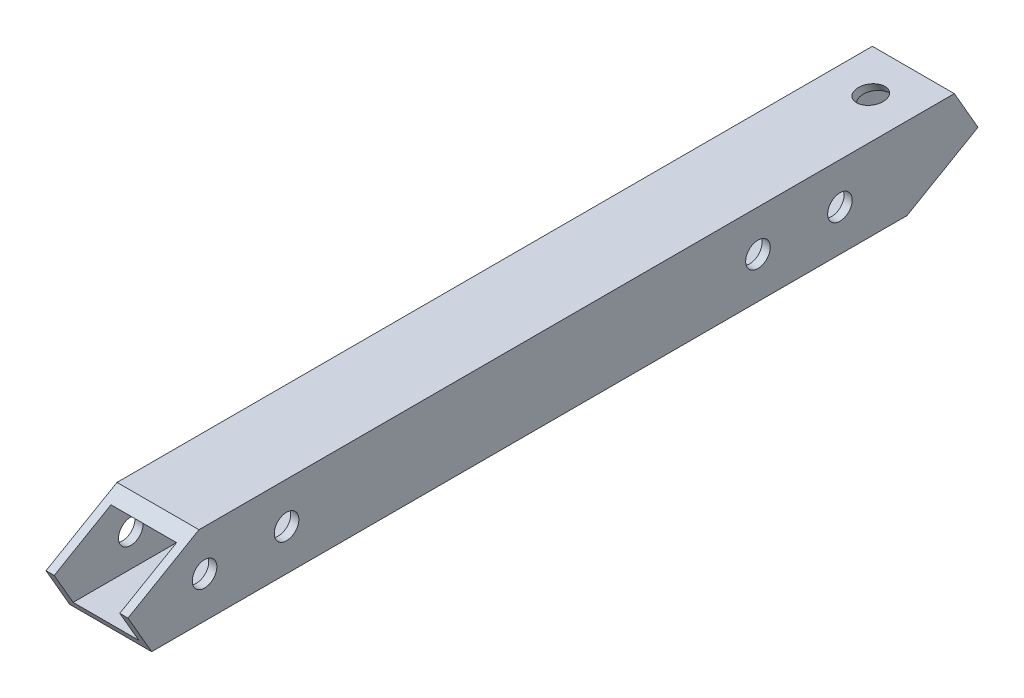
ISO-10303-21;
HEADER;
FILE_DESCRIPTION(('STEP AP214'),'2;1');
FILE_NAME('part.step','',(''),(''),'','','');
FILE_SCHEMA(('AUTOMOTIVE_DESIGN { 1 0 10303 214 1 1 1 1 }'));
ENDSEC;
DATA;
#1=APPLICATION_CONTEXT('core data for automotive mechanical design processes');
#2=APPLICATION_PROTOCOL_DEFINITION('international standard','automotive_design',2000,#1);
#3=PRODUCT_CONTEXT('',#1,'mechanical');
#4=PRODUCT('Part','Part','',(#3));
#5=PRODUCT_RELATED_PRODUCT_CATEGORY('part','',(#4));
#6=PRODUCT_DEFINITION_FORMATION('','',#4);
#7=PRODUCT_DEFINITION_CONTEXT('part definition',#1,'design');
#8=PRODUCT_DEFINITION('design','',#6,#7);
#9=PRODUCT_DEFINITION_SHAPE('','',#8);
#10=(LENGTH_UNIT() NAMED_UNIT(*) SI_UNIT(.MILLI.,.METRE.));
#11=(NAMED_UNIT(*) PLANE_ANGLE_UNIT() SI_UNIT($,.RADIAN.));
#12=(NAMED_UNIT(*) SI_UNIT($,.STERADIAN.) SOLID_ANGLE_UNIT());
#13=UNCERTAINTY_MEASURE_WITH_UNIT(LENGTH_MEASURE(1.E-05),#10,'distance_accuracy_value','');
#14=(GEOMETRIC_REPRESENTATION_CONTEXT(3) GLOBAL_UNCERTAINTY_ASSIGNED_CONTEXT((#13)) GLOBAL_UNIT_ASSIGNED_CONTEXT((#10,
#11,#12)) REPRESENTATION_CONTEXT('',''));
#15=CARTESIAN_POINT('',(0.,0.,0.));
#16=DIRECTION('',(0.,0.,1.));
#17=DIRECTION('',(1.,0.,0.));
#18=AXIS2_PLACEMENT_3D('',#15,#16,#17);
#19=CARTESIAN_POINT('',(-5.,4.,121.));
#20=DIRECTION('',(0.,-1.,0.));
#21=DIRECTION('',(0.,0.,-1.));
#22=AXIS2_PLACEMENT_3D('',#19,#20,#21);
#23=PLANE('',#22);
#24=CARTESIAN_POINT('',(0.,4.,16.1658075373093));
#25=DIRECTION('',(0.,-1.,0.));
#26=DIRECTION('',(0.,0.,1.));
#27=AXIS2_PLACEMENT_3D('',#24,#25,#26);
#28=ELLIPSE('',#27,1.73205080756888,1.5);
#29=CARTESIAN_POINT('',(0.,4.,17.8978583448782));
#30=VERTEX_POINT('',#29);
#31=EDGE_CURVE('E208',#30,#30,#28,.T.);
#32=ORIENTED_EDGE('',*,*,#31,.F.);
#33=EDGE_LOOP('',(#32));
#34=FACE_BOUND('',#33,.T.);
#35=DIRECTION('',(-1.,0.,0.));
#36=VECTOR('',#35,1.);
#37=CARTESIAN_POINT('',(-5.,4.,10.9696551146026));
#38=LINE('',#37,#36);
#39=CARTESIAN_POINT('',(3.99999999999999,4.,10.9696551146026));
#40=VERTEX_POINT('',#39);
#41=CARTESIAN_POINT('',(-4.,4.,10.9696551146026));
#42=VERTEX_POINT('',#41);
#43=EDGE_CURVE('E275',#40,#42,#38,.T.);
#44=ORIENTED_EDGE('',*,*,#43,.F.);
#45=DIRECTION('',(0.,0.,-1.));
#46=VECTOR('',#45,1.);
#47=CARTESIAN_POINT('',(3.99999999999999,4.,121.));
#48=LINE('',#47,#46);
#49=CARTESIAN_POINT('',(3.99999999999999,4.,105.41154273188));
#50=VERTEX_POINT('',#49);
#51=EDGE_CURVE('E255',#50,#40,#48,.T.);
#52=ORIENTED_EDGE('',*,*,#51,.F.);
#53=DIRECTION('',(1.,0.,0.));
#54=VECTOR('',#53,1.);
#55=CARTESIAN_POINT('',(-5.,4.,105.41154273188));
#56=LINE('',#55,#54);
#57=CARTESIAN_POINT('',(-4.,4.,105.41154273188));
#58=VERTEX_POINT('',#57);
#59=EDGE_CURVE('E273',#58,#50,#56,.T.);
#60=ORIENTED_EDGE('',*,*,#59,.F.);
#61=DIRECTION('',(0.,0.,-1.));
#62=VECTOR('',#61,1.);
#63=CARTESIAN_POINT('',(-4.,4.,121.));
#64=LINE('',#63,#62);
#65=EDGE_CURVE('E252',#58,#42,#64,.T.);
#66=ORIENTED_EDGE('',*,*,#65,.T.);
#67=EDGE_LOOP('',(#44,#52,#60,#66));
#68=FACE_BOUND('',#67,.T.);
#69=ADVANCED_FACE('F63',(#34,#68),#23,.T.);
#70=CARTESIAN_POINT('',(3.99999999999999,5.,121.));
#71=DIRECTION('',(-1.,0.,0.));
#72=DIRECTION('',(0.,0.,1.));
#73=AXIS2_PLACEMENT_3D('',#70,#71,#72);
#74=PLANE('',#73);
#75=DIRECTION('',(0.,0.500000000000005,-0.866025403784436));
#76=VECTOR('',#75,1.);
#77=CARTESIAN_POINT('',(3.99999999999999,-47.3945369289588,90.7499999999994));
#78=LINE('',#77,#76);
#79=CARTESIAN_POINT('',(3.99999999999999,-3.99999999999999,15.5884572681197));
#80=VERTEX_POINT('',#79);
#81=CARTESIAN_POINT('',(3.99999999999999,0.,8.66025403784416));
#82=VERTEX_POINT('',#81);
#83=EDGE_CURVE('E12',#80,#82,#78,.T.);
#84=ORIENTED_EDGE('',*,*,#83,.F.);
#85=DIRECTION('',(0.,0.,-1.));
#86=VECTOR('',#85,1.);
#87=CARTESIAN_POINT('',(3.99999999999999,-3.99999999999999,121.));
#88=LINE('',#87,#86);
#89=CARTESIAN_POINT('',(3.99999999999999,-3.99999999999999,110.030344885397));
#90=VERTEX_POINT('',#89);
#91=EDGE_CURVE('E258',#90,#80,#88,.T.);
#92=ORIENTED_EDGE('',*,*,#91,.F.);
#93=DIRECTION('',(0.,-0.866025403784439,-0.5));
#94=VECTOR('',#93,1.);
#95=CARTESIAN_POINT('',(3.99999999999999,7.5,116.669872981078));
#96=LINE('',#95,#94);
#97=CARTESIAN_POINT('',(3.99999999999999,0.,112.339745962156));
#98=VERTEX_POINT('',#97);
#99=EDGE_CURVE('E72',#98,#90,#96,.T.);
#100=ORIENTED_EDGE('',*,*,#99,.F.);
#101=DIRECTION('',(0.,-0.499999999999998,0.866025403784439));
#102=VECTOR('',#101,1.);
#103=CARTESIAN_POINT('',(3.99999999999999,-2.50000000000001,116.669872981078));
#104=LINE('',#103,#102);
#105=EDGE_CURVE('E154',#50,#98,#104,.T.);
#106=ORIENTED_EDGE('',*,*,#105,.F.);
#107=ORIENTED_EDGE('',*,*,#51,.T.);
#108=DIRECTION('',(0.,0.866025403784436,0.500000000000004));
#109=VECTOR('',#108,1.);
#110=CARTESIAN_POINT('',(3.99999999999999,52.3945369289589,38.9102540378447));
#111=LINE('',#110,#109);
#112=EDGE_CURVE('E224',#82,#40,#111,.T.);
#113=ORIENTED_EDGE('',*,*,#112,.F.);
#114=EDGE_LOOP('',(#84,#92,#100,#106,#107,#113));
#115=FACE_BOUND('',#114,.T.);
#116=CARTESIAN_POINT('',(3.99999999999999,0.,25.5));
#117=DIRECTION('',(-1.,0.,0.));
#118=DIRECTION('',(0.,0.,1.));
#119=AXIS2_PLACEMENT_3D('',#116,#117,#118);
#120=CIRCLE('',#119,1.5);
#121=CARTESIAN_POINT('',(3.99999999999999,0.,27.));
#122=VERTEX_POINT('',#121);
#123=EDGE_CURVE('E244',#122,#122,#120,.T.);
#124=ORIENTED_EDGE('',*,*,#123,.F.);
#125=EDGE_LOOP('',(#124));
#126=FACE_BOUND('',#125,.T.);
#127=CARTESIAN_POINT('',(3.99999999999999,0.,35.5));
#128=DIRECTION('',(-1.,0.,0.));
#129=DIRECTION('',(0.,0.,1.));
#130=AXIS2_PLACEMENT_3D('',#127,#128,#129);
#131=CIRCLE('',#130,1.5);
#132=CARTESIAN_POINT('',(3.99999999999999,0.,37.));
#133=VERTEX_POINT('',#132);
#134=EDGE_CURVE('E240',#133,#133,#131,.T.);
#135=ORIENTED_EDGE('',*,*,#134,.F.);
#136=EDGE_LOOP('',(#135));
#137=FACE_BOUND('',#136,.T.);
#138=CARTESIAN_POINT('',(3.99999999999999,0.,103.));
#139=DIRECTION('',(-1.,0.,0.));
#140=DIRECTION('',(0.,0.,1.));
#141=AXIS2_PLACEMENT_3D('',#138,#139,#140);
#142=CIRCLE('',#141,1.5);
#143=CARTESIAN_POINT('',(3.99999999999999,0.,104.5));
#144=VERTEX_POINT('',#143);
#145=EDGE_CURVE('E232',#144,#144,#142,.T.);
#146=ORIENTED_EDGE('',*,*,#145,.F.);
#147=EDGE_LOOP('',(#146));
#148=FACE_BOUND('',#147,.T.);
#149=CARTESIAN_POINT('',(3.99999999999999,0.,93.));
#150=DIRECTION('',(-1.,0.,0.));
#151=DIRECTION('',(0.,0.,1.));
#152=AXIS2_PLACEMENT_3D('',#149,#150,#151);
#153=CIRCLE('',#152,1.5);
#154=CARTESIAN_POINT('',(3.99999999999999,0.,94.5));
#155=VERTEX_POINT('',#154);
#156=EDGE_CURVE('E228',#155,#155,#153,.T.);
#157=ORIENTED_EDGE('',*,*,#156,.F.);
#158=EDGE_LOOP('',(#157));
#159=FACE_BOUND('',#158,.T.);
#160=ADVANCED_FACE('F290',(#115,#126,#137,#148,#159),#74,.T.);
#161=CARTESIAN_POINT('',(-5.,-3.99999999999999,121.));
#162=DIRECTION('',(0.,1.,0.));
#163=DIRECTION('',(0.,0.,1.));
#164=AXIS2_PLACEMENT_3D('',#161,#162,#163);
#165=PLANE('',#164);
#166=DIRECTION('',(1.,0.,0.));
#167=VECTOR('',#166,1.);
#168=CARTESIAN_POINT('',(-5.,-3.99999999999999,15.5884572681197));
#169=LINE('',#168,#167);
#170=CARTESIAN_POINT('',(-4.,-3.99999999999999,15.5884572681197));
#171=VERTEX_POINT('',#170);
#172=EDGE_CURVE('E248',#171,#80,#169,.T.);
#173=ORIENTED_EDGE('',*,*,#172,.F.);
#174=DIRECTION('',(0.,0.,-1.));
#175=VECTOR('',#174,1.);
#176=CARTESIAN_POINT('',(-4.,-3.99999999999999,121.));
#177=LINE('',#176,#175);
#178=CARTESIAN_POINT('',(-4.,-3.99999999999999,110.030344885397));
#179=VERTEX_POINT('',#178);
#180=EDGE_CURVE('E261',#179,#171,#177,.T.);
#181=ORIENTED_EDGE('',*,*,#180,.F.);
#182=DIRECTION('',(-1.,0.,0.));
#183=VECTOR('',#182,1.);
#184=CARTESIAN_POINT('',(-5.,-3.99999999999999,110.030344885397));
#185=LINE('',#184,#183);
#186=EDGE_CURVE('E236',#90,#179,#185,.T.);
#187=ORIENTED_EDGE('',*,*,#186,.F.);
#188=ORIENTED_EDGE('',*,*,#91,.T.);
#189=EDGE_LOOP('',(#173,#181,#187,#188));
#190=FACE_BOUND('',#189,.T.);
#191=ADVANCED_FACE('F293',(#190),#165,.T.);
#192=CARTESIAN_POINT('',(-4.,5.,121.));
#193=DIRECTION('',(1.,0.,0.));
#194=DIRECTION('',(0.,0.,-1.));
#195=AXIS2_PLACEMENT_3D('',#192,#193,#194);
#196=PLANE('',#195);
#197=DIRECTION('',(0.,-0.500000000000005,0.866025403784436));
#198=VECTOR('',#197,1.);
#199=CARTESIAN_POINT('',(-4.,-47.3945369289588,90.7499999999994));
#200=LINE('',#199,#198);
#201=CARTESIAN_POINT('',(-4.,0.,8.66025403784416));
#202=VERTEX_POINT('',#201);
#203=EDGE_CURVE('E250',#202,#171,#200,.T.);
#204=ORIENTED_EDGE('',*,*,#203,.F.);
#205=DIRECTION('',(0.,-0.866025403784436,-0.500000000000004));
#206=VECTOR('',#205,1.);
#207=CARTESIAN_POINT('',(-4.,52.3945369289589,38.9102540378447));
#208=LINE('',#207,#206);
#209=EDGE_CURVE('E226',#42,#202,#208,.T.);
#210=ORIENTED_EDGE('',*,*,#209,.F.);
#211=ORIENTED_EDGE('',*,*,#65,.F.);
#212=DIRECTION('',(0.,0.499999999999998,-0.866025403784439));
#213=VECTOR('',#212,1.);
#214=CARTESIAN_POINT('',(-4.,-2.50000000000001,116.669872981078));
#215=LINE('',#214,#213);
#216=CARTESIAN_POINT('',(-4.,0.,112.339745962156));
#217=VERTEX_POINT('',#216);
#218=EDGE_CURVE('E222',#217,#58,#215,.T.);
#219=ORIENTED_EDGE('',*,*,#218,.F.);
#220=DIRECTION('',(0.,0.866025403784439,0.5));
#221=VECTOR('',#220,1.);
#222=CARTESIAN_POINT('',(-4.,7.5,116.669872981078));
#223=LINE('',#222,#221);
#224=EDGE_CURVE('E238',#179,#217,#223,.T.);
#225=ORIENTED_EDGE('',*,*,#224,.F.);
#226=ORIENTED_EDGE('',*,*,#180,.T.);
#227=EDGE_LOOP('',(#204,#210,#211,#219,#225,#226));
#228=FACE_BOUND('',#227,.T.);
#229=CARTESIAN_POINT('',(-4.,0.,25.5));
#230=DIRECTION('',(1.,0.,0.));
#231=DIRECTION('',(0.,0.,-1.));
#232=AXIS2_PLACEMENT_3D('',#229,#230,#231);
#233=CIRCLE('',#232,1.5);
#234=CARTESIAN_POINT('',(-4.,0.,24.));
#235=VERTEX_POINT('',#234);
#236=EDGE_CURVE('E245',#235,#235,#233,.T.);
#237=ORIENTED_EDGE('',*,*,#236,.F.);
#238=EDGE_LOOP('',(#237));
#239=FACE_BOUND('',#238,.T.);
#240=CARTESIAN_POINT('',(-4.,0.,35.5));
#241=DIRECTION('',(1.,0.,0.));
#242=DIRECTION('',(0.,0.,-1.));
#243=AXIS2_PLACEMENT_3D('',#240,#241,#242);
#244=CIRCLE('',#243,1.5);
#245=CARTESIAN_POINT('',(-4.,0.,34.));
#246=VERTEX_POINT('',#245);
#247=EDGE_CURVE('E241',#246,#246,#244,.T.);
#248=ORIENTED_EDGE('',*,*,#247,.F.);
#249=EDGE_LOOP('',(#248));
#250=FACE_BOUND('',#249,.T.);
#251=CARTESIAN_POINT('',(-4.,0.,103.));
#252=DIRECTION('',(1.,0.,0.));
#253=DIRECTION('',(0.,0.,-1.));
#254=AXIS2_PLACEMENT_3D('',#251,#252,#253);
#255=CIRCLE('',#254,1.5);
#256=CARTESIAN_POINT('',(-4.,0.,101.5));
#257=VERTEX_POINT('',#256);
#258=EDGE_CURVE('E233',#257,#257,#255,.T.);
#259=ORIENTED_EDGE('',*,*,#258,.F.);
#260=EDGE_LOOP('',(#259));
#261=FACE_BOUND('',#260,.T.);
#262=CARTESIAN_POINT('',(-4.,0.,93.));
#263=DIRECTION('',(1.,0.,0.));
#264=DIRECTION('',(0.,0.,-1.));
#265=AXIS2_PLACEMENT_3D('',#262,#263,#264);
#266=CIRCLE('',#265,1.5);
#267=CARTESIAN_POINT('',(-4.,0.,91.5));
#268=VERTEX_POINT('',#267);
#269=EDGE_CURVE('E229',#268,#268,#266,.T.);
#270=ORIENTED_EDGE('',*,*,#269,.F.);
#271=EDGE_LOOP('',(#270));
#272=FACE_BOUND('',#271,.T.);
#273=ADVANCED_FACE('F338',(#228,#239,#250,#261,#272),#196,.T.);
#274=CARTESIAN_POINT('',(-5.,0.,112.339745962156));
#275=DIRECTION('',(0.,-0.86602540378444,-0.499999999999998));
#276=DIRECTION('',(0.,0.499999999999998,-0.866025403784439));
#277=AXIS2_PLACEMENT_3D('',#274,#275,#276);
#278=PLANE('',#277);
#279=ORIENTED_EDGE('',*,*,#218,.T.);
#280=ORIENTED_EDGE('',*,*,#59,.T.);
#281=ORIENTED_EDGE('',*,*,#105,.T.);
#282=DIRECTION('',(1.,0.,0.));
#283=VECTOR('',#282,1.);
#284=CARTESIAN_POINT('',(-5.,0.,112.339745962156));
#285=LINE('',#284,#283);
#286=CARTESIAN_POINT('',(4.99999999999999,0.,112.339745962156));
#287=VERTEX_POINT('',#286);
#288=EDGE_CURVE('E150',#98,#287,#285,.T.);
#289=ORIENTED_EDGE('',*,*,#288,.T.);
#290=DIRECTION('',(0.,0.499999999999998,-0.86602540378444));
#291=VECTOR('',#290,1.);
#292=CARTESIAN_POINT('',(4.99999999999999,0.,112.339745962156));
#293=LINE('',#292,#291);
#294=CARTESIAN_POINT('',(4.99999999999999,5.,103.679491924311));
#295=VERTEX_POINT('',#294);
#296=EDGE_CURVE('E79',#287,#295,#293,.T.);
#297=ORIENTED_EDGE('',*,*,#296,.T.);
#298=DIRECTION('',(1.,0.,0.));
#299=VECTOR('',#298,1.);
#300=CARTESIAN_POINT('',(-5.,5.,103.679491924311));
#301=LINE('',#300,#299);
#302=CARTESIAN_POINT('',(-5.,5.,103.679491924311));
#303=VERTEX_POINT('',#302);
#304=EDGE_CURVE('E158',#303,#295,#301,.T.);
#305=ORIENTED_EDGE('',*,*,#304,.F.);
#306=DIRECTION('',(0.,0.499999999999998,-0.86602540378444));
#307=VECTOR('',#306,1.);
#308=CARTESIAN_POINT('',(-5.,0.,112.339745962156));
#309=LINE('',#308,#307);
#310=CARTESIAN_POINT('',(-5.,0.,112.339745962156));
#311=VERTEX_POINT('',#310);
#312=EDGE_CURVE('E178',#311,#303,#309,.T.);
#313=ORIENTED_EDGE('',*,*,#312,.F.);
#314=EDGE_CURVE('E157',#311,#217,#285,.T.);
#315=ORIENTED_EDGE('',*,*,#314,.T.);
#316=EDGE_LOOP('',(#279,#280,#281,#289,#297,#305,#313,#315));
#317=FACE_BOUND('',#316,.T.);
#318=ADVANCED_FACE('F152',(#317),#278,.F.);
#319=CARTESIAN_POINT('',(-5.,0.,112.339745962156));
#320=DIRECTION('',(0.,0.499999999999999,-0.866025403784439));
#321=DIRECTION('',(0.,0.866025403784439,0.5));
#322=AXIS2_PLACEMENT_3D('',#319,#320,#321);
#323=PLANE('',#322);
#324=ORIENTED_EDGE('',*,*,#224,.T.);
#325=ORIENTED_EDGE('',*,*,#314,.F.);
#326=DIRECTION('',(0.,0.866025403784439,0.499999999999999));
#327=VECTOR('',#326,1.);
#328=CARTESIAN_POINT('',(-5.,0.,112.339745962156));
#329=LINE('',#328,#327);
#330=CARTESIAN_POINT('',(-5.,-4.99999999999999,109.452994616208));
#331=VERTEX_POINT('',#330);
#332=EDGE_CURVE('E175',#331,#311,#329,.T.);
#333=ORIENTED_EDGE('',*,*,#332,.F.);
#334=DIRECTION('',(1.,0.,0.));
#335=VECTOR('',#334,1.);
#336=CARTESIAN_POINT('',(-5.,-4.99999999999999,109.452994616208));
#337=LINE('',#336,#335);
#338=CARTESIAN_POINT('',(4.99999999999999,-4.99999999999999,109.452994616208));
#339=VERTEX_POINT('',#338);
#340=EDGE_CURVE('E164',#331,#339,#337,.T.);
#341=ORIENTED_EDGE('',*,*,#340,.T.);
#342=DIRECTION('',(0.,0.866025403784439,0.499999999999999));
#343=VECTOR('',#342,1.);
#344=CARTESIAN_POINT('',(4.99999999999999,0.,112.339745962156));
#345=LINE('',#344,#343);
#346=EDGE_CURVE('E161',#339,#287,#345,.T.);
#347=ORIENTED_EDGE('',*,*,#346,.T.);
#348=ORIENTED_EDGE('',*,*,#288,.F.);
#349=ORIENTED_EDGE('',*,*,#99,.T.);
#350=ORIENTED_EDGE('',*,*,#186,.T.);
#351=EDGE_LOOP('',(#324,#325,#333,#341,#347,#348,#349,#350));
#352=FACE_BOUND('',#351,.T.);
#353=ADVANCED_FACE('F162',(#352),#323,.F.);
#354=CARTESIAN_POINT('',(-5.,0.,8.66025403784416));
#355=DIRECTION('',(0.,0.866025403784436,0.500000000000005));
#356=DIRECTION('',(0.,-0.500000000000005,0.866025403784436));
#357=AXIS2_PLACEMENT_3D('',#354,#355,#356);
#358=PLANE('',#357);
#359=ORIENTED_EDGE('',*,*,#203,.T.);
#360=ORIENTED_EDGE('',*,*,#172,.T.);
#361=ORIENTED_EDGE('',*,*,#83,.T.);
#362=DIRECTION('',(1.,0.,0.));
#363=VECTOR('',#362,1.);
#364=CARTESIAN_POINT('',(-5.,0.,8.66025403784416));
#365=LINE('',#364,#363);
#366=CARTESIAN_POINT('',(4.99999999999999,0.,8.66025403784416));
#367=VERTEX_POINT('',#366);
#368=EDGE_CURVE('E204',#82,#367,#365,.T.);
#369=ORIENTED_EDGE('',*,*,#368,.T.);
#370=DIRECTION('',(0.,-0.500000000000005,0.866025403784436));
#371=VECTOR('',#370,1.);
#372=CARTESIAN_POINT('',(4.99999999999999,0.,8.66025403784416));
#373=LINE('',#372,#371);
#374=CARTESIAN_POINT('',(4.99999999999999,-5.,17.3205080756886));
#375=VERTEX_POINT('',#374);
#376=EDGE_CURVE('E209',#367,#375,#373,.T.);
#377=ORIENTED_EDGE('',*,*,#376,.T.);
#378=DIRECTION('',(1.,0.,0.));
#379=VECTOR('',#378,1.);
#380=CARTESIAN_POINT('',(-5.,-5.,17.3205080756886));
#381=LINE('',#380,#379);
#382=CARTESIAN_POINT('',(-5.,-5.,17.3205080756886));
#383=VERTEX_POINT('',#382);
#384=EDGE_CURVE('E205',#383,#375,#381,.T.);
#385=ORIENTED_EDGE('',*,*,#384,.F.);
#386=DIRECTION('',(0.,-0.500000000000005,0.866025403784436));
#387=VECTOR('',#386,1.);
#388=CARTESIAN_POINT('',(-5.,0.,8.66025403784416));
#389=LINE('',#388,#387);
#390=CARTESIAN_POINT('',(-5.,0.,8.66025403784416));
#391=VERTEX_POINT('',#390);
#392=EDGE_CURVE('E200',#391,#383,#389,.T.);
#393=ORIENTED_EDGE('',*,*,#392,.F.);
#394=EDGE_CURVE('E201',#391,#202,#365,.T.);
#395=ORIENTED_EDGE('',*,*,#394,.T.);
#396=EDGE_LOOP('',(#359,#360,#361,#369,#377,#385,#393,#395));
#397=FACE_BOUND('',#396,.T.);
#398=ADVANCED_FACE('F374',(#397),#358,.F.);
#399=CARTESIAN_POINT('',(-5.,0.,8.66025403784416));
#400=DIRECTION('',(0.,-0.500000000000004,0.866025403784436));
#401=DIRECTION('',(0.,-0.866025403784436,-0.500000000000004));
#402=AXIS2_PLACEMENT_3D('',#399,#400,#401);
#403=PLANE('',#402);
#404=ORIENTED_EDGE('',*,*,#209,.T.);
#405=ORIENTED_EDGE('',*,*,#394,.F.);
#406=DIRECTION('',(0.,-0.866025403784436,-0.500000000000004));
#407=VECTOR('',#406,1.);
#408=CARTESIAN_POINT('',(-5.,0.,8.66025403784416));
#409=LINE('',#408,#407);
#410=CARTESIAN_POINT('',(-5.,5.,11.5470053837923));
#411=VERTEX_POINT('',#410);
#412=EDGE_CURVE('E87',#411,#391,#409,.T.);
#413=ORIENTED_EDGE('',*,*,#412,.F.);
#414=DIRECTION('',(1.,0.,0.));
#415=VECTOR('',#414,1.);
#416=CARTESIAN_POINT('',(-5.,5.,11.5470053837923));
#417=LINE('',#416,#415);
#418=CARTESIAN_POINT('',(4.99999999999999,5.,11.5470053837923));
#419=VERTEX_POINT('',#418);
#420=EDGE_CURVE('E198',#411,#419,#417,.T.);
#421=ORIENTED_EDGE('',*,*,#420,.T.);
#422=DIRECTION('',(0.,-0.866025403784436,-0.500000000000004));
#423=VECTOR('',#422,1.);
#424=CARTESIAN_POINT('',(4.99999999999999,0.,8.66025403784416));
#425=LINE('',#424,#423);
#426=EDGE_CURVE('E197',#419,#367,#425,.T.);
#427=ORIENTED_EDGE('',*,*,#426,.T.);
#428=ORIENTED_EDGE('',*,*,#368,.F.);
#429=ORIENTED_EDGE('',*,*,#112,.T.);
#430=ORIENTED_EDGE('',*,*,#43,.T.);
#431=EDGE_LOOP('',(#404,#405,#413,#421,#427,#428,#429,#430));
#432=FACE_BOUND('',#431,.T.);
#433=ADVANCED_FACE('F306',(#432),#403,.F.);
#434=CARTESIAN_POINT('',(-5.,0.,93.));
#435=DIRECTION('',(1.,0.,0.));
#436=DIRECTION('',(0.,0.,-1.));
#437=AXIS2_PLACEMENT_3D('',#434,#435,#436);
#438=CYLINDRICAL_SURFACE('',#437,1.5);
#439=ORIENTED_EDGE('',*,*,#156,.T.);
#440=EDGE_LOOP('',(#439));
#441=FACE_BOUND('',#440,.T.);
#442=CARTESIAN_POINT('',(4.99999999999999,0.,93.));
#443=DIRECTION('',(1.,0.,0.));
#444=DIRECTION('',(0.,0.,-1.));
#445=AXIS2_PLACEMENT_3D('',#442,#443,#444);
#446=CIRCLE('',#445,1.5);
#447=CARTESIAN_POINT('',(4.99999999999999,0.,91.5));
#448=VERTEX_POINT('',#447);
#449=EDGE_CURVE('E168',#448,#448,#446,.T.);
#450=ORIENTED_EDGE('',*,*,#449,.T.);
#451=EDGE_LOOP('',(#450));
#452=FACE_BOUND('',#451,.T.);
#453=ADVANCED_FACE('F302',(#441,#452),#438,.F.);
#454=CARTESIAN_POINT('',(-5.,0.,103.));
#455=DIRECTION('',(1.,0.,0.));
#456=DIRECTION('',(0.,0.,-1.));
#457=AXIS2_PLACEMENT_3D('',#454,#455,#456);
#458=CYLINDRICAL_SURFACE('',#457,1.5);
#459=ORIENTED_EDGE('',*,*,#145,.T.);
#460=EDGE_LOOP('',(#459));
#461=FACE_BOUND('',#460,.T.);
#462=CARTESIAN_POINT('',(4.99999999999999,0.,103.));
#463=DIRECTION('',(1.,0.,0.));
#464=DIRECTION('',(0.,0.,-1.));
#465=AXIS2_PLACEMENT_3D('',#462,#463,#464);
#466=CIRCLE('',#465,1.5);
#467=CARTESIAN_POINT('',(4.99999999999999,0.,101.5));
#468=VERTEX_POINT('',#467);
#469=EDGE_CURVE('E378',#468,#468,#466,.T.);
#470=ORIENTED_EDGE('',*,*,#469,.T.);
#471=EDGE_LOOP('',(#470));
#472=FACE_BOUND('',#471,.T.);
#473=ADVANCED_FACE('F305',(#461,#472),#458,.F.);
#474=CARTESIAN_POINT('',(-5.,0.,35.5));
#475=DIRECTION('',(1.,0.,0.));
#476=DIRECTION('',(0.,0.,-1.));
#477=AXIS2_PLACEMENT_3D('',#474,#475,#476);
#478=CYLINDRICAL_SURFACE('',#477,1.5);
#479=ORIENTED_EDGE('',*,*,#134,.T.);
#480=EDGE_LOOP('',(#479));
#481=FACE_BOUND('',#480,.T.);
#482=CARTESIAN_POINT('',(4.99999999999999,0.,35.5));
#483=DIRECTION('',(1.,0.,0.));
#484=DIRECTION('',(0.,0.,-1.));
#485=AXIS2_PLACEMENT_3D('',#482,#483,#484);
#486=CIRCLE('',#485,1.5);
#487=CARTESIAN_POINT('',(4.99999999999999,0.,34.));
#488=VERTEX_POINT('',#487);
#489=EDGE_CURVE('E184',#488,#488,#486,.T.);
#490=ORIENTED_EDGE('',*,*,#489,.T.);
#491=EDGE_LOOP('',(#490));
#492=FACE_BOUND('',#491,.T.);
#493=ADVANCED_FACE('F399',(#481,#492),#478,.F.);
#494=CARTESIAN_POINT('',(-5.,0.,25.5));
#495=DIRECTION('',(1.,0.,0.));
#496=DIRECTION('',(0.,0.,-1.));
#497=AXIS2_PLACEMENT_3D('',#494,#495,#496);
#498=CYLINDRICAL_SURFACE('',#497,1.5);
#499=ORIENTED_EDGE('',*,*,#123,.T.);
#500=EDGE_LOOP('',(#499));
#501=FACE_BOUND('',#500,.T.);
#502=CARTESIAN_POINT('',(4.99999999999999,0.,25.5));
#503=DIRECTION('',(1.,0.,0.));
#504=DIRECTION('',(0.,0.,-1.));
#505=AXIS2_PLACEMENT_3D('',#502,#503,#504);
#506=CIRCLE('',#505,1.5);
#507=CARTESIAN_POINT('',(4.99999999999999,0.,24.));
#508=VERTEX_POINT('',#507);
#509=EDGE_CURVE('E191',#508,#508,#506,.T.);
#510=ORIENTED_EDGE('',*,*,#509,.T.);
#511=EDGE_LOOP('',(#510));
#512=FACE_BOUND('',#511,.T.);
#513=ADVANCED_FACE('F287',(#501,#512),#498,.F.);
#514=ORIENTED_EDGE('',*,*,#269,.T.);
#515=EDGE_LOOP('',(#514));
#516=FACE_BOUND('',#515,.T.);
#517=CARTESIAN_POINT('',(-5.,0.,93.));
#518=DIRECTION('',(1.,0.,0.));
#519=DIRECTION('',(0.,0.,-1.));
#520=AXIS2_PLACEMENT_3D('',#517,#518,#519);
#521=CIRCLE('',#520,1.5);
#522=CARTESIAN_POINT('',(-5.,0.,91.5));
#523=VERTEX_POINT('',#522);
#524=EDGE_CURVE('E216',#523,#523,#521,.T.);
#525=ORIENTED_EDGE('',*,*,#524,.F.);
#526=EDGE_LOOP('',(#525));
#527=FACE_BOUND('',#526,.T.);
#528=ADVANCED_FACE('F308',(#516,#527),#438,.F.);
#529=ORIENTED_EDGE('',*,*,#258,.T.);
#530=EDGE_LOOP('',(#529));
#531=FACE_BOUND('',#530,.T.);
#532=CARTESIAN_POINT('',(-5.,0.,103.));
#533=DIRECTION('',(1.,0.,0.));
#534=DIRECTION('',(0.,0.,-1.));
#535=AXIS2_PLACEMENT_3D('',#532,#533,#534);
#536=CIRCLE('',#535,1.5);
#537=CARTESIAN_POINT('',(-5.,0.,101.5));
#538=VERTEX_POINT('',#537);
#539=EDGE_CURVE('E187',#538,#538,#536,.T.);
#540=ORIENTED_EDGE('',*,*,#539,.F.);
#541=EDGE_LOOP('',(#540));
#542=FACE_BOUND('',#541,.T.);
#543=ADVANCED_FACE('F359',(#531,#542),#458,.F.);
#544=ORIENTED_EDGE('',*,*,#247,.T.);
#545=EDGE_LOOP('',(#544));
#546=FACE_BOUND('',#545,.T.);
#547=CARTESIAN_POINT('',(-5.,0.,35.5));
#548=DIRECTION('',(1.,0.,0.));
#549=DIRECTION('',(0.,0.,-1.));
#550=AXIS2_PLACEMENT_3D('',#547,#548,#549);
#551=CIRCLE('',#550,1.5);
#552=CARTESIAN_POINT('',(-5.,0.,34.));
#553=VERTEX_POINT('',#552);
#554=EDGE_CURVE('E188',#553,#553,#551,.T.);
#555=ORIENTED_EDGE('',*,*,#554,.F.);
#556=EDGE_LOOP('',(#555));
#557=FACE_BOUND('',#556,.T.);
#558=ADVANCED_FACE('F406',(#546,#557),#478,.F.);
#559=ORIENTED_EDGE('',*,*,#236,.T.);
#560=EDGE_LOOP('',(#559));
#561=FACE_BOUND('',#560,.T.);
#562=CARTESIAN_POINT('',(-5.,0.,25.5));
#563=DIRECTION('',(1.,0.,0.));
#564=DIRECTION('',(0.,0.,-1.));
#565=AXIS2_PLACEMENT_3D('',#562,#563,#564);
#566=CIRCLE('',#565,1.5);
#567=CARTESIAN_POINT('',(-5.,0.,24.));
#568=VERTEX_POINT('',#567);
#569=EDGE_CURVE('E194',#568,#568,#566,.T.);
#570=ORIENTED_EDGE('',*,*,#569,.F.);
#571=EDGE_LOOP('',(#570));
#572=FACE_BOUND('',#571,.T.);
#573=ADVANCED_FACE('F364',(#561,#572),#498,.F.);
#574=CARTESIAN_POINT('',(-5.,5.,121.));
#575=DIRECTION('',(1.,0.,0.));
#576=DIRECTION('',(0.,0.,-1.));
#577=AXIS2_PLACEMENT_3D('',#574,#575,#576);
#578=PLANE('',#577);
#579=ORIENTED_EDGE('',*,*,#569,.T.);
#580=EDGE_LOOP('',(#579));
#581=FACE_BOUND('',#580,.T.);
#582=ORIENTED_EDGE('',*,*,#554,.T.);
#583=EDGE_LOOP('',(#582));
#584=FACE_BOUND('',#583,.T.);
#585=ORIENTED_EDGE('',*,*,#539,.T.);
#586=EDGE_LOOP('',(#585));
#587=FACE_BOUND('',#586,.T.);
#588=ORIENTED_EDGE('',*,*,#524,.T.);
#589=EDGE_LOOP('',(#588));
#590=FACE_BOUND('',#589,.T.);
#591=ORIENTED_EDGE('',*,*,#412,.T.);
#592=ORIENTED_EDGE('',*,*,#392,.T.);
#593=DIRECTION('',(0.,0.,-1.));
#594=VECTOR('',#593,1.);
#595=CARTESIAN_POINT('',(-5.,-4.99999999999999,121.));
#596=LINE('',#595,#594);
#597=EDGE_CURVE('E270',#331,#383,#596,.T.);
#598=ORIENTED_EDGE('',*,*,#597,.F.);
#599=ORIENTED_EDGE('',*,*,#332,.T.);
#600=ORIENTED_EDGE('',*,*,#312,.T.);
#601=DIRECTION('',(0.,0.,-1.));
#602=VECTOR('',#601,1.);
#603=CARTESIAN_POINT('',(-5.,5.,121.));
#604=LINE('',#603,#602);
#605=EDGE_CURVE('E264',#303,#411,#604,.T.);
#606=ORIENTED_EDGE('',*,*,#605,.T.);
#607=EDGE_LOOP('',(#591,#592,#598,#599,#600,#606));
#608=FACE_BOUND('',#607,.T.);
#609=ADVANCED_FACE('F65',(#581,#584,#587,#590,#608),#578,.F.);
#610=CARTESIAN_POINT('',(-5.,-4.99999999999999,121.));
#611=DIRECTION('',(0.,1.,0.));
#612=DIRECTION('',(0.,0.,1.));
#613=AXIS2_PLACEMENT_3D('',#610,#611,#612);
#614=PLANE('',#613);
#615=ORIENTED_EDGE('',*,*,#597,.T.);
#616=ORIENTED_EDGE('',*,*,#384,.T.);
#617=DIRECTION('',(0.,0.,-1.));
#618=VECTOR('',#617,1.);
#619=CARTESIAN_POINT('',(4.99999999999999,-4.99999999999999,121.));
#620=LINE('',#619,#618);
#621=EDGE_CURVE('E268',#339,#375,#620,.T.);
#622=ORIENTED_EDGE('',*,*,#621,.F.);
#623=ORIENTED_EDGE('',*,*,#340,.F.);
#624=EDGE_LOOP('',(#615,#616,#622,#623));
#625=FACE_BOUND('',#624,.T.);
#626=ADVANCED_FACE('F313',(#625),#614,.F.);
#627=CARTESIAN_POINT('',(4.99999999999999,5.,121.));
#628=DIRECTION('',(-1.,0.,0.));
#629=DIRECTION('',(0.,0.,1.));
#630=AXIS2_PLACEMENT_3D('',#627,#628,#629);
#631=PLANE('',#630);
#632=ORIENTED_EDGE('',*,*,#509,.F.);
#633=EDGE_LOOP('',(#632));
#634=FACE_BOUND('',#633,.T.);
#635=ORIENTED_EDGE('',*,*,#489,.F.);
#636=EDGE_LOOP('',(#635));
#637=FACE_BOUND('',#636,.T.);
#638=ORIENTED_EDGE('',*,*,#469,.F.);
#639=EDGE_LOOP('',(#638));
#640=FACE_BOUND('',#639,.T.);
#641=ORIENTED_EDGE('',*,*,#449,.F.);
#642=EDGE_LOOP('',(#641));
#643=FACE_BOUND('',#642,.T.);
#644=ORIENTED_EDGE('',*,*,#621,.T.);
#645=ORIENTED_EDGE('',*,*,#376,.F.);
#646=ORIENTED_EDGE('',*,*,#426,.F.);
#647=DIRECTION('',(0.,0.,-1.));
#648=VECTOR('',#647,1.);
#649=CARTESIAN_POINT('',(4.99999999999999,5.,121.));
#650=LINE('',#649,#648);
#651=EDGE_CURVE('E174',#295,#419,#650,.T.);
#652=ORIENTED_EDGE('',*,*,#651,.F.);
#653=ORIENTED_EDGE('',*,*,#296,.F.);
#654=ORIENTED_EDGE('',*,*,#346,.F.);
#655=EDGE_LOOP('',(#644,#645,#646,#652,#653,#654));
#656=FACE_BOUND('',#655,.T.);
#657=ADVANCED_FACE('F171',(#634,#637,#640,#643,#656),#631,.F.);
#658=CARTESIAN_POINT('',(-5.,5.,121.));
#659=DIRECTION('',(0.,-1.,0.));
#660=DIRECTION('',(0.,0.,-1.));
#661=AXIS2_PLACEMENT_3D('',#658,#659,#660);
#662=PLANE('',#661);
#663=CARTESIAN_POINT('',(0.,5.,16.7431578064989));
#664=DIRECTION('',(0.,-1.,0.));
#665=DIRECTION('',(0.,0.,1.));
#666=AXIS2_PLACEMENT_3D('',#663,#664,#665);
#667=ELLIPSE('',#666,1.73205080756888,1.5);
#668=CARTESIAN_POINT('',(0.,5.,18.4752086140678));
#669=VERTEX_POINT('',#668);
#670=EDGE_CURVE('E67',#669,#669,#667,.T.);
#671=ORIENTED_EDGE('',*,*,#670,.T.);
#672=EDGE_LOOP('',(#671));
#673=FACE_BOUND('',#672,.T.);
#674=ORIENTED_EDGE('',*,*,#651,.T.);
#675=ORIENTED_EDGE('',*,*,#420,.F.);
#676=ORIENTED_EDGE('',*,*,#605,.F.);
#677=ORIENTED_EDGE('',*,*,#304,.T.);
#678=EDGE_LOOP('',(#674,#675,#676,#677));
#679=FACE_BOUND('',#678,.T.);
#680=ADVANCED_FACE('F312',(#673,#679),#662,.F.);
#681=CARTESIAN_POINT('',(0.,-5.99999999999998,10.392304845413));
#682=DIRECTION('',(0.,0.866025403784436,0.500000000000004));
#683=DIRECTION('',(0.,-0.500000000000004,0.866025403784436));
#684=AXIS2_PLACEMENT_3D('',#681,#682,#683);
#685=CYLINDRICAL_SURFACE('',#684,1.5);
#686=ORIENTED_EDGE('',*,*,#31,.T.);
#687=EDGE_LOOP('',(#686));
#688=FACE_BOUND('',#687,.T.);
#689=ORIENTED_EDGE('',*,*,#670,.F.);
#690=EDGE_LOOP('',(#689));
#691=FACE_BOUND('',#690,.T.);
#692=ADVANCED_FACE('F321',(#688,#691),#685,.F.);
#693=CLOSED_SHELL('',(#69,#160,#191,#273,#318,#353,#398,#433,#453,#473,#493,#513,#528,#543,#558,
#573,#609,#626,#657,#680,#692));
#694=MANIFOLD_SOLID_BREP('B2',#693);
#695=ADVANCED_BREP_SHAPE_REPRESENTATION('',(#18,#694),#14);
#696=SHAPE_DEFINITION_REPRESENTATION(#9,#695);
ENDSEC;
END-ISO-10303-21;
